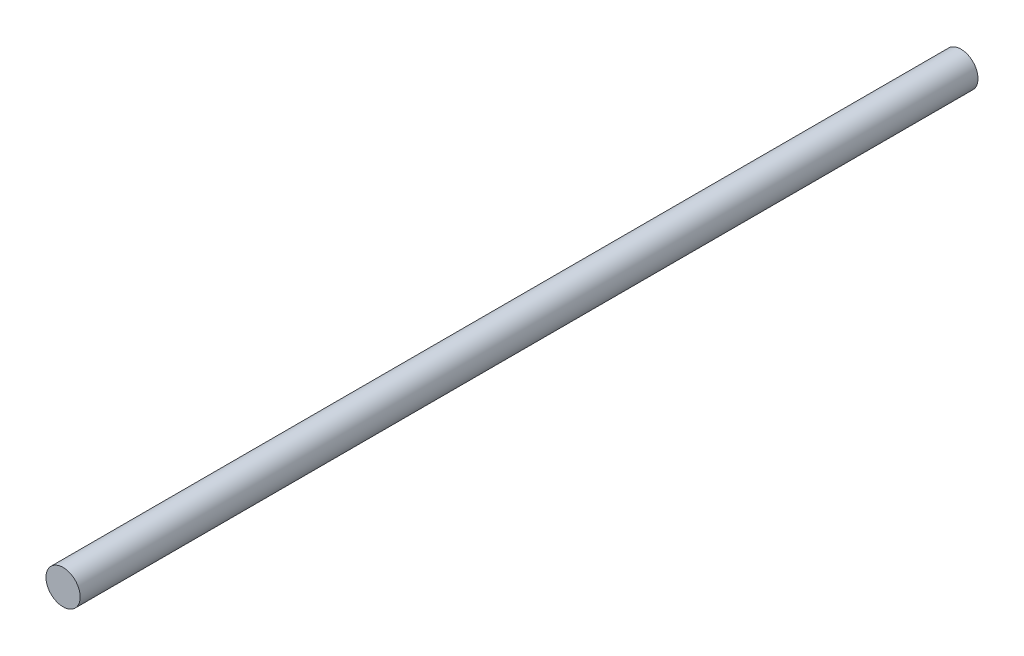
ISO-10303-21;
HEADER;
FILE_DESCRIPTION(('STEP AP214'),'2;1');
FILE_NAME('part.step','',(''),(''),'','','');
FILE_SCHEMA(('AUTOMOTIVE_DESIGN { 1 0 10303 214 1 1 1 1 }'));
ENDSEC;
DATA;
#1=APPLICATION_CONTEXT('core data for automotive mechanical design processes');
#2=APPLICATION_PROTOCOL_DEFINITION('international standard','automotive_design',2000,#1);
#3=PRODUCT_CONTEXT('',#1,'mechanical');
#4=PRODUCT('Part','Part','',(#3));
#5=PRODUCT_RELATED_PRODUCT_CATEGORY('part','',(#4));
#6=PRODUCT_DEFINITION_FORMATION('','',#4);
#7=PRODUCT_DEFINITION_CONTEXT('part definition',#1,'design');
#8=PRODUCT_DEFINITION('design','',#6,#7);
#9=PRODUCT_DEFINITION_SHAPE('','',#8);
#10=(LENGTH_UNIT() NAMED_UNIT(*) SI_UNIT(.MILLI.,.METRE.));
#11=(NAMED_UNIT(*) PLANE_ANGLE_UNIT() SI_UNIT($,.RADIAN.));
#12=(NAMED_UNIT(*) SI_UNIT($,.STERADIAN.) SOLID_ANGLE_UNIT());
#13=UNCERTAINTY_MEASURE_WITH_UNIT(LENGTH_MEASURE(1.E-05),#10,'distance_accuracy_value','');
#14=(GEOMETRIC_REPRESENTATION_CONTEXT(3) GLOBAL_UNCERTAINTY_ASSIGNED_CONTEXT((#13)) GLOBAL_UNIT_ASSIGNED_CONTEXT((#10,
#11,#12)) REPRESENTATION_CONTEXT('',''));
#15=CARTESIAN_POINT('',(0.,0.,0.));
#16=DIRECTION('',(0.,0.,1.));
#17=DIRECTION('',(1.,0.,0.));
#18=AXIS2_PLACEMENT_3D('',#15,#16,#17);
#19=CARTESIAN_POINT('',(0.,0.,210.));
#20=DIRECTION('',(0.,0.,-1.));
#21=DIRECTION('',(-1.,0.,0.));
#22=AXIS2_PLACEMENT_3D('',#19,#20,#21);
#23=CYLINDRICAL_SURFACE('',#22,4.);
#24=CARTESIAN_POINT('',(0.,0.,210.));
#25=DIRECTION('',(0.,0.,1.));
#26=DIRECTION('',(1.,0.,0.));
#27=AXIS2_PLACEMENT_3D('',#24,#25,#26);
#28=CIRCLE('',#27,4.);
#29=CARTESIAN_POINT('',(4.,0.,210.));
#30=VERTEX_POINT('',#29);
#31=EDGE_CURVE('E10',#30,#30,#28,.T.);
#32=ORIENTED_EDGE('',*,*,#31,.F.);
#33=EDGE_LOOP('',(#32));
#34=FACE_BOUND('',#33,.T.);
#35=CARTESIAN_POINT('',(0.,0.,0.));
#36=DIRECTION('',(0.,0.,1.));
#37=DIRECTION('',(1.,0.,0.));
#38=AXIS2_PLACEMENT_3D('',#35,#36,#37);
#39=CIRCLE('',#38,4.);
#40=CARTESIAN_POINT('',(4.,0.,0.));
#41=VERTEX_POINT('',#40);
#42=EDGE_CURVE('E37',#41,#41,#39,.T.);
#43=ORIENTED_EDGE('',*,*,#42,.T.);
#44=EDGE_LOOP('',(#43));
#45=FACE_BOUND('',#44,.T.);
#46=ADVANCED_FACE('F34',(#34,#45),#23,.T.);
#47=CARTESIAN_POINT('',(0.,0.,210.));
#48=DIRECTION('',(0.,0.,1.));
#49=DIRECTION('',(1.,0.,0.));
#50=AXIS2_PLACEMENT_3D('',#47,#48,#49);
#51=PLANE('',#50);
#52=ORIENTED_EDGE('',*,*,#31,.T.);
#53=EDGE_LOOP('',(#52));
#54=FACE_BOUND('',#53,.T.);
#55=ADVANCED_FACE('F49',(#54),#51,.T.);
#56=CARTESIAN_POINT('',(0.,0.,0.));
#57=DIRECTION('',(0.,0.,1.));
#58=DIRECTION('',(1.,0.,0.));
#59=AXIS2_PLACEMENT_3D('',#56,#57,#58);
#60=PLANE('',#59);
#61=ORIENTED_EDGE('',*,*,#42,.F.);
#62=EDGE_LOOP('',(#61));
#63=FACE_BOUND('',#62,.T.);
#64=ADVANCED_FACE('F47',(#63),#60,.F.);
#65=CLOSED_SHELL('',(#46,#55,#64));
#66=MANIFOLD_SOLID_BREP('B2',#65);
#67=ADVANCED_BREP_SHAPE_REPRESENTATION('',(#18,#66),#14);
#68=SHAPE_DEFINITION_REPRESENTATION(#9,#67);
ENDSEC;
END-ISO-10303-21;
